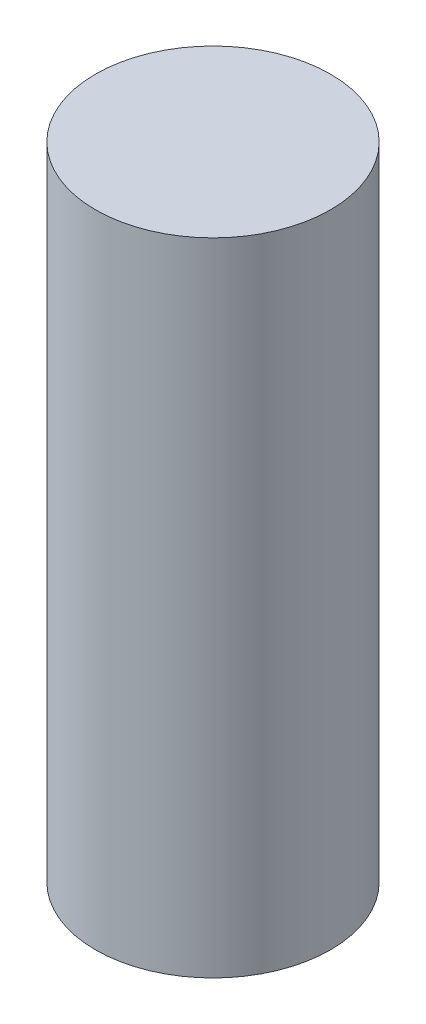
ISO-10303-21;
HEADER;
FILE_DESCRIPTION(('STEP AP214'),'2;1');
FILE_NAME('part.step','',(''),(''),'','','');
FILE_SCHEMA(('AUTOMOTIVE_DESIGN { 1 0 10303 214 1 1 1 1 }'));
ENDSEC;
DATA;
#1=APPLICATION_CONTEXT('core data for automotive mechanical design processes');
#2=APPLICATION_PROTOCOL_DEFINITION('international standard','automotive_design',2000,#1);
#3=PRODUCT_CONTEXT('',#1,'mechanical');
#4=PRODUCT('Part','Part','',(#3));
#5=PRODUCT_RELATED_PRODUCT_CATEGORY('part','',(#4));
#6=PRODUCT_DEFINITION_FORMATION('','',#4);
#7=PRODUCT_DEFINITION_CONTEXT('part definition',#1,'design');
#8=PRODUCT_DEFINITION('design','',#6,#7);
#9=PRODUCT_DEFINITION_SHAPE('','',#8);
#10=(LENGTH_UNIT() NAMED_UNIT(*) SI_UNIT(.MILLI.,.METRE.));
#11=(NAMED_UNIT(*) PLANE_ANGLE_UNIT() SI_UNIT($,.RADIAN.));
#12=(NAMED_UNIT(*) SI_UNIT($,.STERADIAN.) SOLID_ANGLE_UNIT());
#13=UNCERTAINTY_MEASURE_WITH_UNIT(LENGTH_MEASURE(1.E-05),#10,'distance_accuracy_value','');
#14=(GEOMETRIC_REPRESENTATION_CONTEXT(3) GLOBAL_UNCERTAINTY_ASSIGNED_CONTEXT((#13)) GLOBAL_UNIT_ASSIGNED_CONTEXT((#10,
#11,#12)) REPRESENTATION_CONTEXT('',''));
#15=CARTESIAN_POINT('',(0.,0.,0.));
#16=DIRECTION('',(0.,0.,1.));
#17=DIRECTION('',(1.,0.,0.));
#18=AXIS2_PLACEMENT_3D('',#15,#16,#17);
#19=CARTESIAN_POINT('',(0.,15.,0.));
#20=DIRECTION('',(0.,-1.,0.));
#21=DIRECTION('',(0.,0.,-1.));
#22=AXIS2_PLACEMENT_3D('',#19,#20,#21);
#23=CYLINDRICAL_SURFACE('',#22,2.75);
#24=CARTESIAN_POINT('',(0.,15.,0.));
#25=DIRECTION('',(0.,1.,0.));
#26=DIRECTION('',(0.,0.,1.));
#27=AXIS2_PLACEMENT_3D('',#24,#25,#26);
#28=CIRCLE('',#27,2.75);
#29=CARTESIAN_POINT('',(0.,15.,2.75));
#30=VERTEX_POINT('',#29);
#31=EDGE_CURVE('E10',#30,#30,#28,.T.);
#32=ORIENTED_EDGE('',*,*,#31,.F.);
#33=EDGE_LOOP('',(#32));
#34=FACE_BOUND('',#33,.T.);
#35=CARTESIAN_POINT('',(0.,0.,0.));
#36=DIRECTION('',(0.,1.,0.));
#37=DIRECTION('',(0.,0.,1.));
#38=AXIS2_PLACEMENT_3D('',#35,#36,#37);
#39=CIRCLE('',#38,2.75);
#40=CARTESIAN_POINT('',(0.,0.,2.75));
#41=VERTEX_POINT('',#40);
#42=EDGE_CURVE('E34',#41,#41,#39,.T.);
#43=ORIENTED_EDGE('',*,*,#42,.T.);
#44=EDGE_LOOP('',(#43));
#45=FACE_BOUND('',#44,.T.);
#46=ADVANCED_FACE('F31',(#34,#45),#23,.T.);
#47=CARTESIAN_POINT('',(0.,15.,0.));
#48=DIRECTION('',(0.,1.,0.));
#49=DIRECTION('',(0.,0.,1.));
#50=AXIS2_PLACEMENT_3D('',#47,#48,#49);
#51=PLANE('',#50);
#52=ORIENTED_EDGE('',*,*,#31,.T.);
#53=EDGE_LOOP('',(#52));
#54=FACE_BOUND('',#53,.T.);
#55=ADVANCED_FACE('F46',(#54),#51,.T.);
#56=CARTESIAN_POINT('',(0.,0.,0.));
#57=DIRECTION('',(0.,1.,0.));
#58=DIRECTION('',(0.,0.,1.));
#59=AXIS2_PLACEMENT_3D('',#56,#57,#58);
#60=PLANE('',#59);
#61=ORIENTED_EDGE('',*,*,#42,.F.);
#62=EDGE_LOOP('',(#61));
#63=FACE_BOUND('',#62,.T.);
#64=ADVANCED_FACE('F44',(#63),#60,.F.);
#65=CLOSED_SHELL('',(#46,#55,#64));
#66=MANIFOLD_SOLID_BREP('B2',#65);
#67=ADVANCED_BREP_SHAPE_REPRESENTATION('',(#18,#66),#14);
#68=SHAPE_DEFINITION_REPRESENTATION(#9,#67);
ENDSEC;
END-ISO-10303-21;
